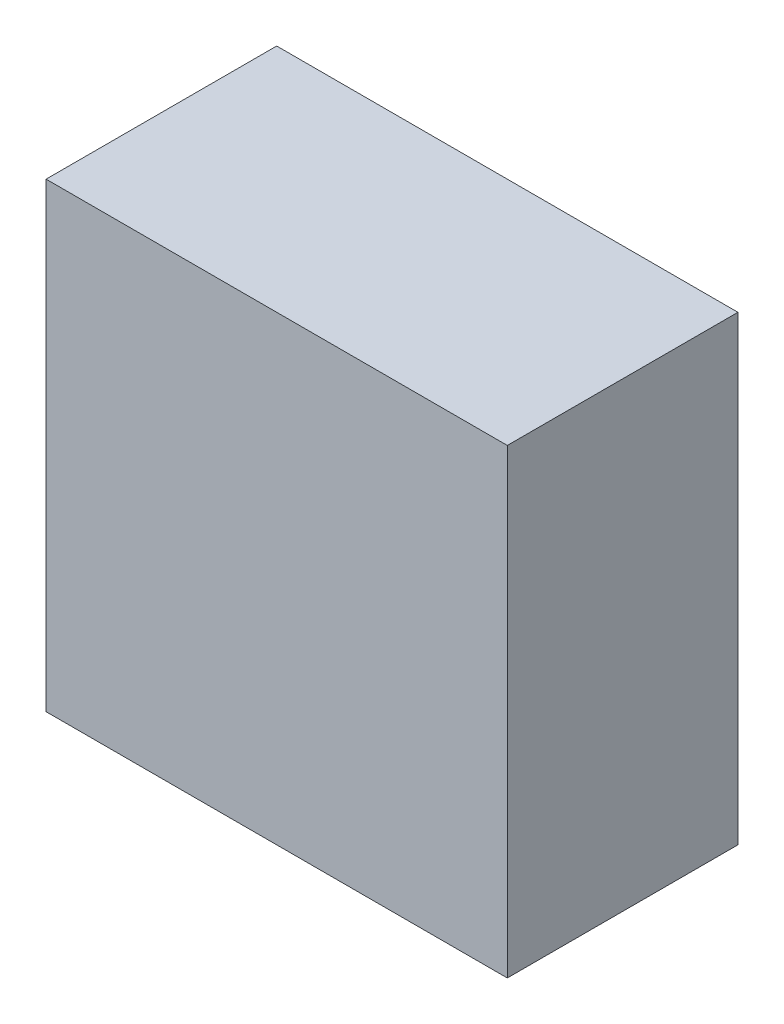
ISO-10303-21;
HEADER;
FILE_DESCRIPTION(('STEP AP214'),'2;1');
FILE_NAME('part.step','',(''),(''),'','','');
FILE_SCHEMA(('AUTOMOTIVE_DESIGN { 1 0 10303 214 1 1 1 1 }'));
ENDSEC;
DATA;
#1=APPLICATION_CONTEXT('core data for automotive mechanical design processes');
#2=APPLICATION_PROTOCOL_DEFINITION('international standard','automotive_design',2000,#1);
#3=PRODUCT_CONTEXT('',#1,'mechanical');
#4=PRODUCT('Part','Part','',(#3));
#5=PRODUCT_RELATED_PRODUCT_CATEGORY('part','',(#4));
#6=PRODUCT_DEFINITION_FORMATION('','',#4);
#7=PRODUCT_DEFINITION_CONTEXT('part definition',#1,'design');
#8=PRODUCT_DEFINITION('design','',#6,#7);
#9=PRODUCT_DEFINITION_SHAPE('','',#8);
#10=(LENGTH_UNIT() NAMED_UNIT(*) SI_UNIT(.MILLI.,.METRE.));
#11=(NAMED_UNIT(*) PLANE_ANGLE_UNIT() SI_UNIT($,.RADIAN.));
#12=(NAMED_UNIT(*) SI_UNIT($,.STERADIAN.) SOLID_ANGLE_UNIT());
#13=UNCERTAINTY_MEASURE_WITH_UNIT(LENGTH_MEASURE(1.E-05),#10,'distance_accuracy_value','');
#14=(GEOMETRIC_REPRESENTATION_CONTEXT(3) GLOBAL_UNCERTAINTY_ASSIGNED_CONTEXT((#13)) GLOBAL_UNIT_ASSIGNED_CONTEXT((#10,
#11,#12)) REPRESENTATION_CONTEXT('',''));
#15=CARTESIAN_POINT('',(0.,0.,0.));
#16=DIRECTION('',(0.,0.,1.));
#17=DIRECTION('',(1.,0.,0.));
#18=AXIS2_PLACEMENT_3D('',#15,#16,#17);
#19=CARTESIAN_POINT('',(0.,0.,2.75));
#20=DIRECTION('',(0.,0.,-1.));
#21=DIRECTION('',(-1.,0.,0.));
#22=AXIS2_PLACEMENT_3D('',#19,#20,#21);
#23=PLANE('',#22);
#24=DIRECTION('',(1.,0.,0.));
#25=VECTOR('',#24,1.);
#26=CARTESIAN_POINT('',(82.,165.941489418563,2.75));
#27=LINE('',#26,#25);
#28=CARTESIAN_POINT('',(78.,165.941489418563,2.75));
#29=VERTEX_POINT('',#28);
#30=CARTESIAN_POINT('',(82.,165.941489418563,2.75));
#31=VERTEX_POINT('',#30);
#32=EDGE_CURVE('E80',#29,#31,#27,.T.);
#33=ORIENTED_EDGE('',*,*,#32,.T.);
#34=DIRECTION('',(0.,1.,0.));
#35=VECTOR('',#34,1.);
#36=CARTESIAN_POINT('',(82.,169.941489418563,2.75));
#37=LINE('',#36,#35);
#38=CARTESIAN_POINT('',(82.,169.941489418563,2.75));
#39=VERTEX_POINT('',#38);
#40=EDGE_CURVE('E55',#31,#39,#37,.T.);
#41=ORIENTED_EDGE('',*,*,#40,.T.);
#42=DIRECTION('',(1.,0.,0.));
#43=VECTOR('',#42,1.);
#44=CARTESIAN_POINT('',(82.,169.941489418563,2.75));
#45=LINE('',#44,#43);
#46=CARTESIAN_POINT('',(78.,169.941489418563,2.75));
#47=VERTEX_POINT('',#46);
#48=EDGE_CURVE('E57',#39,#47,#45,.F.);
#49=ORIENTED_EDGE('',*,*,#48,.T.);
#50=DIRECTION('',(0.,1.,0.));
#51=VECTOR('',#50,1.);
#52=CARTESIAN_POINT('',(78.,169.941489418563,2.75));
#53=LINE('',#52,#51);
#54=EDGE_CURVE('E20',#47,#29,#53,.F.);
#55=ORIENTED_EDGE('',*,*,#54,.T.);
#56=EDGE_LOOP('',(#33,#41,#49,#55));
#57=FACE_BOUND('',#56,.T.);
#58=ADVANCED_FACE('F17',(#57),#23,.F.);
#59=CARTESIAN_POINT('',(78.,169.941489418563,2.75));
#60=DIRECTION('',(1.,0.,0.));
#61=DIRECTION('',(0.,0.,-1.));
#62=AXIS2_PLACEMENT_3D('',#59,#60,#61);
#63=PLANE('',#62);
#64=DIRECTION('',(0.,0.,1.));
#65=VECTOR('',#64,1.);
#66=CARTESIAN_POINT('',(78.,165.941489418563,2.75));
#67=LINE('',#66,#65);
#68=CARTESIAN_POINT('',(78.,165.941489418563,0.75));
#69=VERTEX_POINT('',#68);
#70=EDGE_CURVE('E68',#69,#29,#67,.T.);
#71=ORIENTED_EDGE('',*,*,#70,.T.);
#72=ORIENTED_EDGE('',*,*,#54,.F.);
#73=DIRECTION('',(0.,0.,-1.));
#74=VECTOR('',#73,1.);
#75=CARTESIAN_POINT('',(78.,169.941489418563,2.75));
#76=LINE('',#75,#74);
#77=CARTESIAN_POINT('',(78.,169.941489418563,0.75));
#78=VERTEX_POINT('',#77);
#79=EDGE_CURVE('E63',#47,#78,#76,.T.);
#80=ORIENTED_EDGE('',*,*,#79,.T.);
#81=DIRECTION('',(0.,1.,0.));
#82=VECTOR('',#81,1.);
#83=CARTESIAN_POINT('',(78.,0.,0.75));
#84=LINE('',#83,#82);
#85=EDGE_CURVE('E83',#69,#78,#84,.T.);
#86=ORIENTED_EDGE('',*,*,#85,.F.);
#87=EDGE_LOOP('',(#71,#72,#80,#86));
#88=FACE_BOUND('',#87,.T.);
#89=ADVANCED_FACE('F65',(#88),#63,.F.);
#90=CARTESIAN_POINT('',(82.,169.941489418563,2.75));
#91=DIRECTION('',(0.,-1.,0.));
#92=DIRECTION('',(0.,0.,-1.));
#93=AXIS2_PLACEMENT_3D('',#90,#91,#92);
#94=PLANE('',#93);
#95=ORIENTED_EDGE('',*,*,#79,.F.);
#96=ORIENTED_EDGE('',*,*,#48,.F.);
#97=DIRECTION('',(0.,0.,1.));
#98=VECTOR('',#97,1.);
#99=CARTESIAN_POINT('',(82.,169.941489418563,2.75));
#100=LINE('',#99,#98);
#101=CARTESIAN_POINT('',(82.,169.941489418563,0.75));
#102=VERTEX_POINT('',#101);
#103=EDGE_CURVE('E75',#39,#102,#100,.F.);
#104=ORIENTED_EDGE('',*,*,#103,.T.);
#105=DIRECTION('',(-1.,0.,0.));
#106=VECTOR('',#105,1.);
#107=CARTESIAN_POINT('',(0.,169.941489418563,0.75));
#108=LINE('',#107,#106);
#109=EDGE_CURVE('E72',#78,#102,#108,.F.);
#110=ORIENTED_EDGE('',*,*,#109,.F.);
#111=EDGE_LOOP('',(#95,#96,#104,#110));
#112=FACE_BOUND('',#111,.T.);
#113=ADVANCED_FACE('F70',(#112),#94,.F.);
#114=CARTESIAN_POINT('',(82.,169.941489418563,2.75));
#115=DIRECTION('',(-1.,0.,0.));
#116=DIRECTION('',(0.,0.,1.));
#117=AXIS2_PLACEMENT_3D('',#114,#115,#116);
#118=PLANE('',#117);
#119=ORIENTED_EDGE('',*,*,#103,.F.);
#120=ORIENTED_EDGE('',*,*,#40,.F.);
#121=DIRECTION('',(0.,0.,1.));
#122=VECTOR('',#121,1.);
#123=CARTESIAN_POINT('',(82.,165.941489418563,2.75));
#124=LINE('',#123,#122);
#125=CARTESIAN_POINT('',(82.,165.941489418563,0.75));
#126=VERTEX_POINT('',#125);
#127=EDGE_CURVE('E35',#31,#126,#124,.F.);
#128=ORIENTED_EDGE('',*,*,#127,.T.);
#129=DIRECTION('',(0.,1.,0.));
#130=VECTOR('',#129,1.);
#131=CARTESIAN_POINT('',(82.,0.,0.75));
#132=LINE('',#131,#130);
#133=EDGE_CURVE('E26',#102,#126,#132,.F.);
#134=ORIENTED_EDGE('',*,*,#133,.F.);
#135=EDGE_LOOP('',(#119,#120,#128,#134));
#136=FACE_BOUND('',#135,.T.);
#137=ADVANCED_FACE('F89',(#136),#118,.F.);
#138=CARTESIAN_POINT('',(82.,165.941489418563,2.75));
#139=DIRECTION('',(0.,1.,0.));
#140=DIRECTION('',(0.,0.,1.));
#141=AXIS2_PLACEMENT_3D('',#138,#139,#140);
#142=PLANE('',#141);
#143=ORIENTED_EDGE('',*,*,#127,.F.);
#144=ORIENTED_EDGE('',*,*,#32,.F.);
#145=ORIENTED_EDGE('',*,*,#70,.F.);
#146=DIRECTION('',(-1.,0.,0.));
#147=VECTOR('',#146,1.);
#148=CARTESIAN_POINT('',(0.,165.941489418563,0.75));
#149=LINE('',#148,#147);
#150=EDGE_CURVE('E11',#126,#69,#149,.T.);
#151=ORIENTED_EDGE('',*,*,#150,.F.);
#152=EDGE_LOOP('',(#143,#144,#145,#151));
#153=FACE_BOUND('',#152,.T.);
#154=ADVANCED_FACE('F91',(#153),#142,.F.);
#155=CARTESIAN_POINT('',(0.,0.,0.75));
#156=DIRECTION('',(0.,0.,-1.));
#157=DIRECTION('',(-1.,0.,0.));
#158=AXIS2_PLACEMENT_3D('',#155,#156,#157);
#159=PLANE('',#158);
#160=ORIENTED_EDGE('',*,*,#133,.T.);
#161=ORIENTED_EDGE('',*,*,#150,.T.);
#162=ORIENTED_EDGE('',*,*,#85,.T.);
#163=ORIENTED_EDGE('',*,*,#109,.T.);
#164=EDGE_LOOP('',(#160,#161,#162,#163));
#165=FACE_BOUND('',#164,.T.);
#166=ADVANCED_FACE('F88',(#165),#159,.T.);
#167=CLOSED_SHELL('',(#58,#89,#113,#137,#154,#166));
#168=MANIFOLD_SOLID_BREP('B1',#167);
#169=ADVANCED_BREP_SHAPE_REPRESENTATION('',(#18,#168),#14);
#170=SHAPE_DEFINITION_REPRESENTATION(#9,#169);
ENDSEC;
END-ISO-10303-21;
